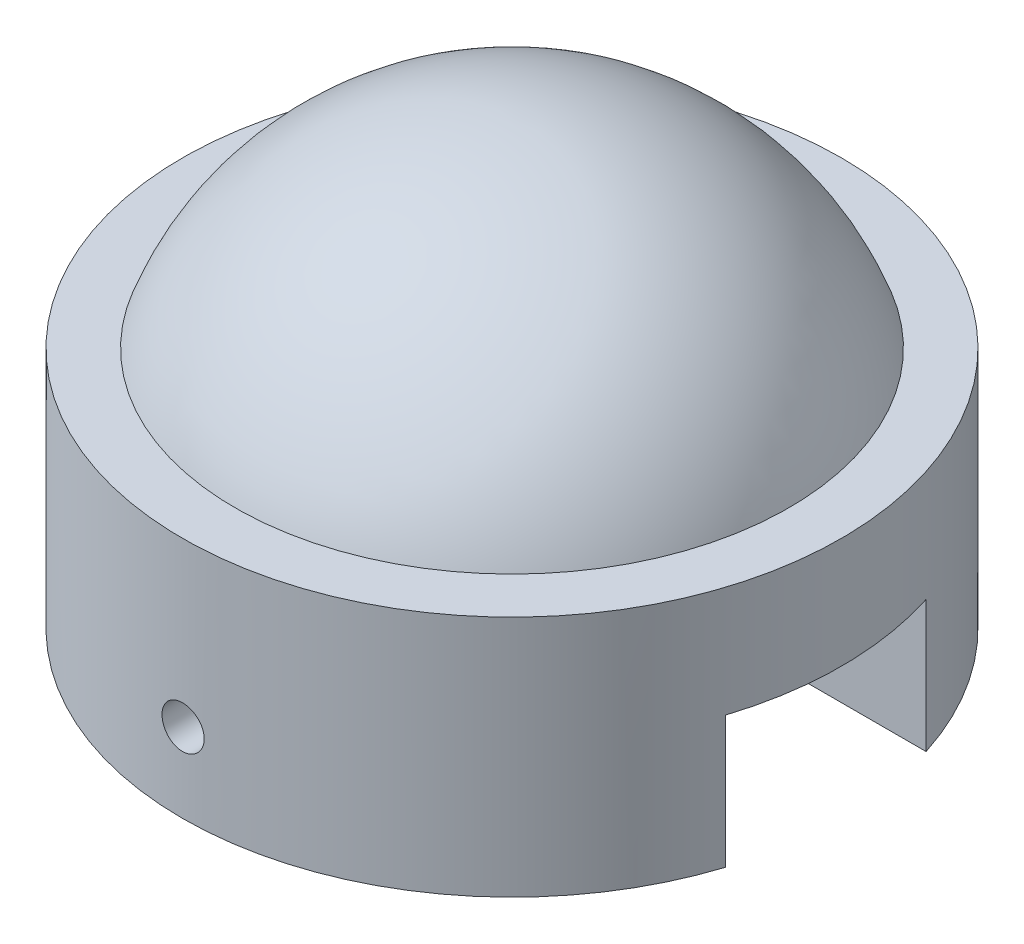
ISO-10303-21;
HEADER;
FILE_DESCRIPTION(('STEP AP214'),'2;1');
FILE_NAME('part.step','',(''),(''),'','','');
FILE_SCHEMA(('AUTOMOTIVE_DESIGN { 1 0 10303 214 1 1 1 1 }'));
ENDSEC;
DATA;
#1=APPLICATION_CONTEXT('core data for automotive mechanical design processes');
#2=APPLICATION_PROTOCOL_DEFINITION('international standard','automotive_design',2000,#1);
#3=PRODUCT_CONTEXT('',#1,'mechanical');
#4=PRODUCT('Part','Part','',(#3));
#5=PRODUCT_RELATED_PRODUCT_CATEGORY('part','',(#4));
#6=PRODUCT_DEFINITION_FORMATION('','',#4);
#7=PRODUCT_DEFINITION_CONTEXT('part definition',#1,'design');
#8=PRODUCT_DEFINITION('design','',#6,#7);
#9=PRODUCT_DEFINITION_SHAPE('','',#8);
#10=(LENGTH_UNIT() NAMED_UNIT(*) SI_UNIT(.MILLI.,.METRE.));
#11=(NAMED_UNIT(*) PLANE_ANGLE_UNIT() SI_UNIT($,.RADIAN.));
#12=(NAMED_UNIT(*) SI_UNIT($,.STERADIAN.) SOLID_ANGLE_UNIT());
#13=UNCERTAINTY_MEASURE_WITH_UNIT(LENGTH_MEASURE(1.E-05),#10,'distance_accuracy_value','');
#14=(GEOMETRIC_REPRESENTATION_CONTEXT(3) GLOBAL_UNCERTAINTY_ASSIGNED_CONTEXT((#13)) GLOBAL_UNIT_ASSIGNED_CONTEXT((#10,
#11,#12)) REPRESENTATION_CONTEXT('',''));
#15=CARTESIAN_POINT('',(0.,0.,0.));
#16=DIRECTION('',(0.,0.,1.));
#17=DIRECTION('',(1.,0.,0.));
#18=AXIS2_PLACEMENT_3D('',#15,#16,#17);
#19=CARTESIAN_POINT('',(-3.9,0.,0.));
#20=DIRECTION('',(0.,1.,0.));
#21=DIRECTION('',(0.,0.,1.));
#22=AXIS2_PLACEMENT_3D('',#19,#20,#21);
#23=PLANE('',#22);
#24=DIRECTION('',(-1.,0.,0.));
#25=VECTOR('',#24,1.);
#26=CARTESIAN_POINT('',(10.,0.,-1.9));
#27=LINE('',#26,#25);
#28=CARTESIAN_POINT('',(-3.40587727318528,0.,-1.9));
#29=VERTEX_POINT('',#28);
#30=CARTESIAN_POINT('',(-5.95420019817943,0.,-1.9));
#31=VERTEX_POINT('',#30);
#32=EDGE_CURVE('E207',#29,#31,#27,.T.);
#33=ORIENTED_EDGE('',*,*,#32,.T.);
#34=CARTESIAN_POINT('',(0.,0.,0.));
#35=DIRECTION('',(0.,-1.,0.));
#36=DIRECTION('',(0.,0.,-1.));
#37=AXIS2_PLACEMENT_3D('',#34,#35,#36);
#38=CIRCLE('',#37,6.25);
#39=CARTESIAN_POINT('',(5.95420019817943,0.,-1.9));
#40=VERTEX_POINT('',#39);
#41=EDGE_CURVE('E124',#31,#40,#38,.T.);
#42=ORIENTED_EDGE('',*,*,#41,.T.);
#43=CARTESIAN_POINT('',(3.40587727318528,0.,-1.9));
#44=VERTEX_POINT('',#43);
#45=EDGE_CURVE('E212',#40,#44,#27,.T.);
#46=ORIENTED_EDGE('',*,*,#45,.T.);
#47=CARTESIAN_POINT('',(0.,0.,0.));
#48=DIRECTION('',(0.,-1.,0.));
#49=DIRECTION('',(0.,0.,-1.));
#50=AXIS2_PLACEMENT_3D('',#47,#48,#49);
#51=CIRCLE('',#50,3.9);
#52=EDGE_CURVE('E139',#29,#44,#51,.T.);
#53=ORIENTED_EDGE('',*,*,#52,.F.);
#54=EDGE_LOOP('',(#33,#42,#46,#53));
#55=FACE_BOUND('',#54,.T.);
#56=ADVANCED_FACE('F33',(#55),#23,.F.);
#57=DIRECTION('',(-1.,0.,0.));
#58=VECTOR('',#57,1.);
#59=CARTESIAN_POINT('',(10.,0.,1.9));
#60=LINE('',#59,#58);
#61=CARTESIAN_POINT('',(5.95420019817943,0.,1.9));
#62=VERTEX_POINT('',#61);
#63=CARTESIAN_POINT('',(3.40587727318528,0.,1.9));
#64=VERTEX_POINT('',#63);
#65=EDGE_CURVE('E104',#62,#64,#60,.T.);
#66=ORIENTED_EDGE('',*,*,#65,.F.);
#67=CARTESIAN_POINT('',(-5.95420019817943,0.,1.9));
#68=VERTEX_POINT('',#67);
#69=EDGE_CURVE('E116',#62,#68,#38,.T.);
#70=ORIENTED_EDGE('',*,*,#69,.T.);
#71=CARTESIAN_POINT('',(-3.40587727318528,0.,1.9));
#72=VERTEX_POINT('',#71);
#73=EDGE_CURVE('E60',#72,#68,#60,.T.);
#74=ORIENTED_EDGE('',*,*,#73,.F.);
#75=EDGE_CURVE('E118',#64,#72,#51,.T.);
#76=ORIENTED_EDGE('',*,*,#75,.F.);
#77=EDGE_LOOP('',(#66,#70,#74,#76));
#78=FACE_BOUND('',#77,.T.);
#79=ADVANCED_FACE('F115',(#78),#23,.F.);
#80=CARTESIAN_POINT('',(0.,0.,0.));
#81=DIRECTION('',(0.,-1.,0.));
#82=DIRECTION('',(0.,0.,-1.));
#83=AXIS2_PLACEMENT_3D('',#80,#81,#82);
#84=CYLINDRICAL_SURFACE('',#83,3.9);
#85=CARTESIAN_POINT('',(0.,1.9,-3.9));
#86=CARTESIAN_POINT('',(0.0224050360369174,1.89999903130887,-3.89999973621022));
#87=CARTESIAN_POINT('',(0.0448248102239473,1.89811121514567,-3.89980487819636));
#88=CARTESIAN_POINT('',(0.089042582149286,1.89060896527527,-3.89904628875805));
#89=CARTESIAN_POINT('',(0.110839870809206,1.88499044568791,-3.89848215290876));
#90=CARTESIAN_POINT('',(0.153165968103049,1.87019225898817,-3.89704867680895));
#91=CARTESIAN_POINT('',(0.173695542151248,1.86101476555457,-3.89617952288201));
#92=CARTESIAN_POINT('',(0.212918477646498,1.83936341776893,-3.89423314908145));
#93=CARTESIAN_POINT('',(0.231612198574761,1.82689021052806,-3.89315597006458));
#94=CARTESIAN_POINT('',(0.266707784916821,1.79895098298983,-3.8909096258248));
#95=CARTESIAN_POINT('',(0.283101742843247,1.78347505270229,-3.88974016383611));
#96=CARTESIAN_POINT('',(0.31306446115213,1.74999083863106,-3.88744350750644));
#97=CARTESIAN_POINT('',(0.326633089691566,1.73198243673613,-3.88631631513997));
#98=CARTESIAN_POINT('',(0.350588139183903,1.6938947868407,-3.88422880153916));
#99=CARTESIAN_POINT('',(0.360967379022695,1.67381099977894,-3.88326885895079));
#100=CARTESIAN_POINT('',(0.378203168631359,1.63217413300122,-3.88162823644546));
#101=CARTESIAN_POINT('',(0.385059809687443,1.61062109137658,-3.88094754929185));
#102=CARTESIAN_POINT('',(0.395032264238243,1.56673832494834,-3.87994520570983));
#103=CARTESIAN_POINT('',(0.398161217916159,1.54441161556473,-3.87962228841814));
#104=CARTESIAN_POINT('',(0.400630100836543,1.49954778714652,-3.8793681375379));
#105=CARTESIAN_POINT('',(0.399970134524708,1.47701067392903,-3.87943689315247));
#106=CARTESIAN_POINT('',(0.394890737825368,1.43245645492763,-3.87995716792142));
#107=CARTESIAN_POINT('',(0.390485666401369,1.41043769267821,-3.88040722511922));
#108=CARTESIAN_POINT('',(0.378063451163112,1.36745365397513,-3.88163710963168));
#109=CARTESIAN_POINT('',(0.370046256275926,1.34648839242191,-3.88241694160911));
#110=CARTESIAN_POINT('',(0.350611561952498,1.30616119252546,-3.8842201882922));
#111=CARTESIAN_POINT('',(0.339187704062033,1.28680233964341,-3.88524405776426));
#112=CARTESIAN_POINT('',(0.313268532203266,1.25027125177685,-3.88741963367097));
#113=CARTESIAN_POINT('',(0.298773123645499,1.23309908415815,-3.88857134404202));
#114=CARTESIAN_POINT('',(0.267042180912524,1.20134539095005,-3.89087934613934));
#115=CARTESIAN_POINT('',(0.249794248187567,1.18677625189999,-3.89203563433556));
#116=CARTESIAN_POINT('',(0.213090881645087,1.16073822597723,-3.89421746691946));
#117=CARTESIAN_POINT('',(0.19363544515332,1.14926934286034,-3.89524301114875));
#118=CARTESIAN_POINT('',(0.153060667919829,1.1297578385191,-3.89704816699728));
#119=CARTESIAN_POINT('',(0.131941016253038,1.12171585934963,-3.89782773252357));
#120=CARTESIAN_POINT('',(0.0886414246791094,1.10929559278069,-3.89905262995733));
#121=CARTESIAN_POINT('',(0.066461518154561,1.10491719011211,-3.89949797238059));
#122=CARTESIAN_POINT('',(0.0217782753334561,1.09996410862448,-3.90000289305564));
#123=CARTESIAN_POINT('',(-0.000723147810683021,1.09937234003915,-3.9000642044824));
#124=CARTESIAN_POINT('',(-0.0455048507816828,1.10196441919759,-3.89979880534974));
#125=CARTESIAN_POINT('',(-0.0677851337495857,1.10514821323622,-3.89947210030964));
#126=CARTESIAN_POINT('',(-0.111442673121615,1.1151868616078,-3.89846848642197));
#127=CARTESIAN_POINT('',(-0.132821791663694,1.12203370052843,-3.89779234232038));
#128=CARTESIAN_POINT('',(-0.174128044853109,1.13919583588782,-3.89616568925689));
#129=CARTESIAN_POINT('',(-0.194055145337151,1.14951121390284,-3.89521517384213));
#130=CARTESIAN_POINT('',(-0.231968886525854,1.17335989844567,-3.89314174738375));
#131=CARTESIAN_POINT('',(-0.24994844138033,1.18690441715917,-3.89201824060576));
#132=CARTESIAN_POINT('',(-0.283384957496126,1.21681084746333,-3.88972677487453));
#133=CARTESIAN_POINT('',(-0.298841852071503,1.2331728335096,-3.88855881474718));
#134=CARTESIAN_POINT('',(-0.326853741467384,1.26832437685696,-3.88630485167593));
#135=CARTESIAN_POINT('',(-0.339397509653901,1.28712290451826,-3.88521917631926));
#136=CARTESIAN_POINT('',(-0.361149862592383,1.32656973179389,-3.88325772586681));
#137=CARTESIAN_POINT('',(-0.37035849499238,1.34721800497624,-3.88238194777236));
#138=CARTESIAN_POINT('',(-0.385160439515946,1.38973990451383,-3.8809415118253));
#139=CARTESIAN_POINT('',(-0.390760398976992,1.41161119674579,-3.88037628221332));
#140=CARTESIAN_POINT('',(-0.398207589471724,1.45598973526181,-3.87961917617117));
#141=CARTESIAN_POINT('',(-0.400054934234572,1.47849696225187,-3.87942728842626));
#142=CARTESIAN_POINT('',(-0.399942830814951,1.52339687943605,-3.87943883854268));
#143=CARTESIAN_POINT('',(-0.398001018114547,1.54578961621698,-3.87964044500576));
#144=CARTESIAN_POINT('',(-0.390402731347687,1.58992894490839,-3.88041235949326));
#145=CARTESIAN_POINT('',(-0.384746253395842,1.61167553614298,-3.88098266790332));
#146=CARTESIAN_POINT('',(-0.369884130782164,1.65390492865067,-3.88242721328932));
#147=CARTESIAN_POINT('',(-0.36067903523041,1.67438792488281,-3.88330140324082));
#148=CARTESIAN_POINT('',(-0.338982782846501,1.71352100814817,-3.88525530576914));
#149=CARTESIAN_POINT('',(-0.326491638832624,1.73217110233082,-3.88633501754426));
#150=CARTESIAN_POINT('',(-0.298511694167548,1.76719934519414,-3.88858432819315));
#151=CARTESIAN_POINT('',(-0.283009747892725,1.78356696928079,-3.88975430716862));
#152=CARTESIAN_POINT('',(-0.249474458835927,1.81347621976018,-3.89204886236119));
#153=CARTESIAN_POINT('',(-0.231440511557419,1.82701716937984,-3.8931734276533));
#154=CARTESIAN_POINT('',(-0.193300893843417,1.85091700369955,-3.89525354700934));
#155=CARTESIAN_POINT('',(-0.173189894132027,1.86126741704842,-3.89620864831887));
#156=CARTESIAN_POINT('',(-0.131518235690599,1.87843046552348,-3.89783734588499));
#157=CARTESIAN_POINT('',(-0.10995923696413,1.8852470762115,-3.89851125831439));
#158=CARTESIAN_POINT('',(-0.0735659323831241,1.89345553029148,-3.89933294475621));
#159=CARTESIAN_POINT('',(-0.0589640028883835,1.89590633737246,-3.89958191923254));
#160=CARTESIAN_POINT('',(-0.029576856287532,1.89917888840929,-3.89991553356945));
#161=CARTESIAN_POINT('',(-0.0147916399870197,1.90000063952276,-3.90000017415207));
#162=CARTESIAN_POINT('',(0.,1.9,-3.9));
#163=B_SPLINE_CURVE_WITH_KNOTS('',3,(#85,#86,#87,#88,#89,#90,#91,#92,#93,#94,#95,#96,#97,#98,
#99,#100,#101,#102,#103,#104,#105,#106,#107,#108,#109,#110,#111,#112,#113,#114,#115,#116,#117,
#118,#119,#120,#121,#122,#123,#124,#125,#126,#127,#128,#129,#130,#131,#132,#133,#134,#135,#136,
#137,#138,#139,#140,#141,#142,#143,#144,#145,#146,#147,#148,#149,#150,#151,#152,#153,#154,#155,
#156,#157,#158,#159,#160,#161,#162),.UNSPECIFIED.,.T.,.F.,(4,2,2,2,2,2,2,2,2,2,2,2,2,2,2,2,2,2,
2,2,2,2,2,2,2,2,2,2,2,2,2,2,2,2,2,2,2,2,4),(0.,0.0671610931620392,0.134395862990819,
0.201589633023958,0.268770219397855,0.336176416052526,0.403585757489488,0.471145781707632,
0.538704055056545,0.606023472585476,0.67334103439042,0.740401654472328,0.807463222774796,
0.874650751765174,0.941840350119507,1.00934161659733,1.07684296484937,1.14435695440569,
1.21186881965267,1.27907577542404,1.34628177522772,1.41334131391417,1.48040242987821,
1.54769987577989,1.614999100386,1.68255353192952,1.75010699830615,1.81753566975117,
1.88496229762886,1.95207585715313,2.0191894868756,2.0862927356577,2.15339572268611,
2.2207985596855,2.28821751606417,2.35581396788451,2.42333420711121,2.46767366161611,
2.51201292130535),.UNSPECIFIED.);
#164=CARTESIAN_POINT('',(0.,1.9,-3.9));
#165=VERTEX_POINT('',#164);
#166=EDGE_CURVE('E172',#165,#165,#163,.T.);
#167=ORIENTED_EDGE('',*,*,#166,.T.);
#168=EDGE_LOOP('',(#167));
#169=FACE_BOUND('',#168,.T.);
#170=CARTESIAN_POINT('',(0.4,1.5,3.87943294825416));
#171=CARTESIAN_POINT('',(0.399999030996807,1.5224046865797,3.87943321725911));
#172=CARTESIAN_POINT('',(0.398111271733158,1.54482411240049,3.8796291292902));
#173=CARTESIAN_POINT('',(0.390609268414111,1.5890411605254,3.88039148365016));
#174=CARTESIAN_POINT('',(0.384990937267086,1.61083807347723,3.88095833235515));
#175=CARTESIAN_POINT('',(0.370193301804084,1.6531633762959,3.88239769229377));
#176=CARTESIAN_POINT('',(0.361016180123982,1.67369253475821,3.8832700161452));
#177=CARTESIAN_POINT('',(0.339365707818552,1.71291477378848,3.88522180732534));
#178=CARTESIAN_POINT('',(0.326893003393002,1.73160821332071,3.88630123403385));
#179=CARTESIAN_POINT('',(0.298954283990447,1.766704116899,3.8885502225038));
#180=CARTESIAN_POINT('',(0.283478246667961,1.78309858444927,3.88972007794092));
#181=CARTESIAN_POINT('',(0.249993604479354,1.8130622864872,3.89201544727453));
#182=CARTESIAN_POINT('',(0.231984882893414,1.82663139069526,3.89314095912436));
#183=CARTESIAN_POINT('',(0.193896952383097,1.85058693800163,3.89522373840269));
#184=CARTESIAN_POINT('',(0.173813259376506,1.86096628723477,3.89618062883916));
#185=CARTESIAN_POINT('',(0.132176597010932,1.8782023050293,3.89781515047165));
#186=CARTESIAN_POINT('',(0.110623665203589,1.88505906358487,3.89849278880185));
#187=CARTESIAN_POINT('',(0.066741237048571,1.89503176306127,3.89949039271603));
#188=CARTESIAN_POINT('',(0.0444147583461273,1.89816085464525,3.89981161540528));
#189=CARTESIAN_POINT('',(-0.000448618250968849,1.90063009330453,3.90006447197801));
#190=CARTESIAN_POINT('',(-0.0229855104117429,1.89997034332864,3.89999611644694));
#191=CARTESIAN_POINT('',(-0.0675406825498407,1.89489128948764,3.89947854624816));
#192=CARTESIAN_POINT('',(-0.0895605935138925,1.89048612680219,3.89903076416483));
#193=CARTESIAN_POINT('',(-0.132546882514425,1.87806333100316,3.8978063041059));
#194=CARTESIAN_POINT('',(-0.153513246254447,1.870045648883,3.89702962166853));
#195=CARTESIAN_POINT('',(-0.193841783586396,1.85060994499782,3.89523221212191));
#196=CARTESIAN_POINT('',(-0.213200926797134,1.83918567834116,3.8942110374973));
#197=CARTESIAN_POINT('',(-0.249732422031208,1.81326563366964,3.89203919703728));
#198=CARTESIAN_POINT('',(-0.266904706539635,1.79876976086186,3.89088852720603));
#199=CARTESIAN_POINT('',(-0.298657876648993,1.76703848841306,3.8885805404873));
#200=CARTESIAN_POINT('',(-0.313226469409928,1.74979078511301,3.88742321738451));
#201=CARTESIAN_POINT('',(-0.339263502375182,1.71308807238632,3.88523764213965));
#202=CARTESIAN_POINT('',(-0.350731937690617,1.69363305947888,3.88420939020112));
#203=CARTESIAN_POINT('',(-0.370243119735034,1.65305839785227,3.88239829699401));
#204=CARTESIAN_POINT('',(-0.378285086269966,1.63193837131167,3.88161551162794));
#205=CARTESIAN_POINT('',(-0.390705212733786,1.58863796477296,3.8803851274376));
#206=CARTESIAN_POINT('',(-0.39508349021159,1.56645761881918,3.87993751785931));
#207=CARTESIAN_POINT('',(-0.400036099408696,1.5217741702285,3.87943003608846));
#208=CARTESIAN_POINT('',(-0.400627638224474,1.49927299389958,3.87936840999867));
#209=CARTESIAN_POINT('',(-0.398035187622991,1.45449183972601,3.87963524327794));
#210=CARTESIAN_POINT('',(-0.39485125192046,1.43221185873889,3.87996369709723));
#211=CARTESIAN_POINT('',(-0.384812637446832,1.38855582840869,3.88097208546549));
#212=CARTESIAN_POINT('',(-0.377966112950599,1.36717788442873,3.88165123911096));
#213=CARTESIAN_POINT('',(-0.360804999721467,1.32587384129241,3.88328386967787));
#214=CARTESIAN_POINT('',(-0.350490327556261,1.30594777707757,3.88423735319871));
#215=CARTESIAN_POINT('',(-0.326642683309124,1.26803474439411,3.88631545104621));
#216=CARTESIAN_POINT('',(-0.313098319750441,1.25005497469871,3.88744066591379));
#217=CARTESIAN_POINT('',(-0.283192074102151,1.2166179528585,3.88973348454209));
#218=CARTESIAN_POINT('',(-0.266830118606802,1.2011607664541,3.89090108940654));
#219=CARTESIAN_POINT('',(-0.231678448368392,1.17314824295712,3.8931524310015));
#220=CARTESIAN_POINT('',(-0.212879757738741,1.16060413861936,3.89423583270959));
#221=CARTESIAN_POINT('',(-0.173432514558528,1.13885119594298,3.89619180821333));
#222=CARTESIAN_POINT('',(-0.152783988500523,1.1296423098483,3.89706438502767));
#223=CARTESIAN_POINT('',(-0.110262245761607,1.11484019831059,3.89849888401578));
#224=CARTESIAN_POINT('',(-0.0883914017061293,1.10924021559892,3.89906138648171));
#225=CARTESIAN_POINT('',(-0.0440138086870632,1.10179282675156,3.8998147415447));
#226=CARTESIAN_POINT('',(-0.0215070786094926,1.099945309285,3.90000560516781));
#227=CARTESIAN_POINT('',(0.0233931322592455,1.10005690742464,3.89999416745876));
#228=CARTESIAN_POINT('',(0.0457866588586806,1.10199859633436,3.89979366602765));
#229=CARTESIAN_POINT('',(0.0899275981830778,1.1095969132956,3.89902558052867));
#230=CARTESIAN_POINT('',(0.111675010474538,1.11525354383955,3.89845799621453));
#231=CARTESIAN_POINT('',(0.153906054051694,1.13011628304939,3.8970193270836));
#232=CARTESIAN_POINT('',(0.174389877352365,1.13932185086982,3.89614828851412));
#233=CARTESIAN_POINT('',(0.213524417784899,1.1610193039577,3.89419974606402));
#234=CARTESIAN_POINT('',(0.232175142579189,1.17351117548746,3.89312224304649));
#235=CARTESIAN_POINT('',(0.267203353106964,1.20149192218366,3.8908755170325));
#236=CARTESIAN_POINT('',(0.283570446689805,1.216993776457,3.88970591035641));
#237=CARTESIAN_POINT('',(0.313478669786864,1.25052866297329,3.88741003020044));
#238=CARTESIAN_POINT('',(0.327019121135368,1.26856230090797,3.88628376717227));
#239=CARTESIAN_POINT('',(0.350918417043304,1.30670166470862,3.88419888822739));
#240=CARTESIAN_POINT('',(0.361268701314714,1.32681277558432,3.88324072629607));
#241=CARTESIAN_POINT('',(0.378431477709382,1.36848466942964,3.88160593334562));
#242=CARTESIAN_POINT('',(0.385247947123085,1.39004379165222,3.88092898599225));
#243=CARTESIAN_POINT('',(0.393456004614913,1.42643671854524,3.88010340350025));
#244=CARTESIAN_POINT('',(0.395906633184329,1.4410381188358,3.87985317752112));
#245=CARTESIAN_POINT('',(0.399178947088685,1.47042420533096,3.87951786147196));
#246=CARTESIAN_POINT('',(0.400000639715806,1.48520889071477,3.87943277066268));
#247=CARTESIAN_POINT('',(0.4,1.5,3.87943294825416));
#248=B_SPLINE_CURVE_WITH_KNOTS('',3,(#170,#171,#172,#173,#174,#175,#176,#177,#178,#179,#180,
#181,#182,#183,#184,#185,#186,#187,#188,#189,#190,#191,#192,#193,#194,#195,#196,#197,#198,#199,
#200,#201,#202,#203,#204,#205,#206,#207,#208,#209,#210,#211,#212,#213,#214,#215,#216,#217,#218,
#219,#220,#221,#222,#223,#224,#225,#226,#227,#228,#229,#230,#231,#232,#233,#234,#235,#236,#237,
#238,#239,#240,#241,#242,#243,#244,#245,#246,#247),.UNSPECIFIED.,.T.,.F.,(4,2,2,2,2,2,2,2,2,2,2,
2,2,2,2,2,2,2,2,2,2,2,2,2,2,2,2,2,2,2,2,2,2,2,2,2,2,2,4),(0.,0.067160043459882,
0.134393786919231,0.201586360413217,0.268765768513101,0.336173338860716,0.403584016733184,
0.471143545625014,0.538701348438966,0.606020104677001,0.673337031766604,0.740400919994249,
0.80746571802198,0.874654221900009,0.941844799586727,1.00934467483684,1.07684465653226,
1.14435999951668,1.21187317619834,1.27907935115014,1.34628456995242,1.41334078405776,
1.48039861143203,1.5476965518924,1.61499624590794,1.68255128925235,1.75010536525675,
1.81753258344805,1.88495780113031,1.95207365850354,2.01918956090624,2.08629523912435,
2.15340063682601,2.22080209169681,2.28821969893216,2.3558166661597,2.42333738726957,
2.46767525318395,2.51201292061271),.UNSPECIFIED.);
#249=CARTESIAN_POINT('',(0.4,1.5,3.87943294825416));
#250=VERTEX_POINT('',#249);
#251=EDGE_CURVE('E167',#250,#250,#248,.T.);
#252=ORIENTED_EDGE('',*,*,#251,.T.);
#253=EDGE_LOOP('',(#252));
#254=FACE_BOUND('',#253,.T.);
#255=CARTESIAN_POINT('',(0.,4.2,0.));
#256=DIRECTION('',(0.,-1.,0.));
#257=DIRECTION('',(0.,0.,-1.));
#258=AXIS2_PLACEMENT_3D('',#255,#256,#257);
#259=CIRCLE('',#258,3.9);
#260=CARTESIAN_POINT('',(0.,4.2,-3.9));
#261=VERTEX_POINT('',#260);
#262=EDGE_CURVE('E136',#261,#261,#259,.T.);
#263=ORIENTED_EDGE('',*,*,#262,.F.);
#264=EDGE_LOOP('',(#263));
#265=FACE_BOUND('',#264,.T.);
#266=DIRECTION('',(0.,-1.,0.));
#267=VECTOR('',#266,1.);
#268=CARTESIAN_POINT('',(3.40587727318528,0.,-1.9));
#269=LINE('',#268,#267);
#270=CARTESIAN_POINT('',(3.40587727318528,2.5,-1.9));
#271=VERTEX_POINT('',#270);
#272=EDGE_CURVE('E234',#271,#44,#269,.T.);
#273=ORIENTED_EDGE('',*,*,#272,.F.);
#274=CARTESIAN_POINT('',(0.,2.5,0.));
#275=DIRECTION('',(0.,-1.,0.));
#276=DIRECTION('',(0.,0.,-1.));
#277=AXIS2_PLACEMENT_3D('',#274,#275,#276);
#278=CIRCLE('',#277,3.9);
#279=CARTESIAN_POINT('',(3.40587727318528,2.5,1.9));
#280=VERTEX_POINT('',#279);
#281=EDGE_CURVE('E223',#280,#271,#278,.F.);
#282=ORIENTED_EDGE('',*,*,#281,.F.);
#283=DIRECTION('',(0.,-1.,0.));
#284=VECTOR('',#283,1.);
#285=CARTESIAN_POINT('',(3.40587727318528,0.,1.9));
#286=LINE('',#285,#284);
#287=EDGE_CURVE('E227',#64,#280,#286,.F.);
#288=ORIENTED_EDGE('',*,*,#287,.F.);
#289=ORIENTED_EDGE('',*,*,#75,.T.);
#290=DIRECTION('',(0.,-1.,0.));
#291=VECTOR('',#290,1.);
#292=CARTESIAN_POINT('',(-3.40587727318528,0.,1.9));
#293=LINE('',#292,#291);
#294=CARTESIAN_POINT('',(-3.40587727318528,2.5,1.9));
#295=VERTEX_POINT('',#294);
#296=EDGE_CURVE('E224',#295,#72,#293,.T.);
#297=ORIENTED_EDGE('',*,*,#296,.F.);
#298=CARTESIAN_POINT('',(-3.40587727318528,2.5,-1.9));
#299=VERTEX_POINT('',#298);
#300=EDGE_CURVE('E233',#299,#295,#278,.F.);
#301=ORIENTED_EDGE('',*,*,#300,.F.);
#302=DIRECTION('',(0.,-1.,0.));
#303=VECTOR('',#302,1.);
#304=CARTESIAN_POINT('',(-3.40587727318528,0.,-1.9));
#305=LINE('',#304,#303);
#306=EDGE_CURVE('E130',#29,#299,#305,.F.);
#307=ORIENTED_EDGE('',*,*,#306,.F.);
#308=ORIENTED_EDGE('',*,*,#52,.T.);
#309=EDGE_LOOP('',(#273,#282,#288,#289,#297,#301,#307,#308));
#310=FACE_BOUND('',#309,.T.);
#311=ADVANCED_FACE('F177',(#169,#254,#265,#310),#84,.F.);
#312=CARTESIAN_POINT('',(0.,0.,0.));
#313=DIRECTION('',(0.,-1.,0.));
#314=DIRECTION('',(0.,0.,-1.));
#315=AXIS2_PLACEMENT_3D('',#312,#313,#314);
#316=CYLINDRICAL_SURFACE('',#315,6.25);
#317=CARTESIAN_POINT('',(0.,1.9,-6.25));
#318=CARTESIAN_POINT('',(-0.0224435293456439,1.89999901290593,-6.24999982999009));
#319=CARTESIAN_POINT('',(-0.0449027462962842,1.89810473223254,-6.24987781651468));
#320=CARTESIAN_POINT('',(-0.0892009521053,1.8905753042846,-6.24940281084195));
#321=CARTESIAN_POINT('',(-0.111039189488894,1.8849358102119,-6.24904955025967));
#322=CARTESIAN_POINT('',(-0.153447367682333,1.87007866742751,-6.24815201093505));
#323=CARTESIAN_POINT('',(-0.174017973888437,1.86086291480323,-6.24760783342912));
#324=CARTESIAN_POINT('',(-0.213314942150303,1.83911795074811,-6.24638965384087));
#325=CARTESIAN_POINT('',(-0.232041723488104,1.82658949501852,-6.2457156813772));
#326=CARTESIAN_POINT('',(-0.267154086248556,1.79855332420001,-6.24431248294859));
#327=CARTESIAN_POINT('',(-0.283536403111893,1.78304152400417,-6.24358318206106));
#328=CARTESIAN_POINT('',(-0.313466877774332,1.74948742601905,-6.24215216205289));
#329=CARTESIAN_POINT('',(-0.327014916777447,1.73144502221493,-6.24145044408937));
#330=CARTESIAN_POINT('',(-0.350902406161839,1.69332327180022,-6.24015314296202));
#331=CARTESIAN_POINT('',(-0.361239130244036,1.67324221352271,-6.23955765016143));
#332=CARTESIAN_POINT('',(-0.378393126056472,1.63162517640297,-6.23854092798865));
#333=CARTESIAN_POINT('',(-0.385210437145424,1.61008921383445,-6.23811969666766));
#334=CARTESIAN_POINT('',(-0.39512299005704,1.56620526526469,-6.23749971648003));
#335=CARTESIAN_POINT('',(-0.398223365351893,1.54385844322216,-6.2373006607922));
#336=CARTESIAN_POINT('',(-0.400629886125329,1.49896074178302,-6.23714656076724));
#337=CARTESIAN_POINT('',(-0.399936076335905,1.47640986479526,-6.23719151355334));
#338=CARTESIAN_POINT('',(-0.394778180447233,1.43177918197551,-6.23752007632056));
#339=CARTESIAN_POINT('',(-0.390319650999692,1.40969873102095,-6.23780333456531));
#340=CARTESIAN_POINT('',(-0.377767496734641,1.36660027773082,-6.23857603343271));
#341=CARTESIAN_POINT('',(-0.369673849273662,1.34558228201428,-6.2390654753397));
#342=CARTESIAN_POINT('',(-0.350074905311028,1.30518752090016,-6.24019579004026));
#343=CARTESIAN_POINT('',(-0.338567089887375,1.2858119808996,-6.24083677456854));
#344=CARTESIAN_POINT('',(-0.312468299518514,1.24926552906424,-6.2421978293331));
#345=CARTESIAN_POINT('',(-0.297877288172704,1.23209464326171,-6.24291790050304));
#346=CARTESIAN_POINT('',(-0.265995003370657,1.20041258988416,-6.24435754442314));
#347=CARTESIAN_POINT('',(-0.248698921272166,1.18590626075408,-6.24507711394843));
#348=CARTESIAN_POINT('',(-0.211914319876018,1.16000242904606,-6.24643342090367));
#349=CARTESIAN_POINT('',(-0.192425799777114,1.14860492760426,-6.24707015830335));
#350=CARTESIAN_POINT('',(-0.151806582540981,1.12924268753214,-6.24818910538994));
#351=CARTESIAN_POINT('',(-0.130675796882755,1.12127813409542,-6.24867130673991));
#352=CARTESIAN_POINT('',(-0.0873731934026922,1.10901111644356,-6.24942673407828));
#353=CARTESIAN_POINT('',(-0.0652013883315491,1.10470860738703,-6.24969996262554));
#354=CARTESIAN_POINT('',(-0.020488099886413,1.09989381078506,-6.25000632646719));
#355=CARTESIAN_POINT('',(0.00205266041056363,1.09937483405523,-6.25003988548878));
#356=CARTESIAN_POINT('',(0.0469009118336964,1.10212435331865,-6.24986425605434));
#357=CARTESIAN_POINT('',(0.0692084042329397,1.10539282863054,-6.24965506892382));
#358=CARTESIAN_POINT('',(0.112938033333791,1.11561893293836,-6.24901776762715));
#359=CARTESIAN_POINT('',(0.134360891055967,1.12257349096489,-6.2485898357134));
#360=CARTESIAN_POINT('',(0.175735393457801,1.13997122609859,-6.24756318409439));
#361=CARTESIAN_POINT('',(0.195687024266058,1.15041443609323,-6.24696446277912));
#362=CARTESIAN_POINT('',(0.233583339182231,1.17451004513163,-6.24566244101044));
#363=CARTESIAN_POINT('',(0.251525179072476,1.18816690946008,-6.24495899554984));
#364=CARTESIAN_POINT('',(0.284863972035593,1.21829566242458,-6.24352716887002));
#365=CARTESIAN_POINT('',(0.30026089886377,1.23476758008762,-6.24279878739374));
#366=CARTESIAN_POINT('',(0.328095480442748,1.27008773234529,-6.24139795339497));
#367=CARTESIAN_POINT('',(0.340528793937329,1.28893939187253,-6.24072558384754));
#368=CARTESIAN_POINT('',(0.362053512514474,1.32846669460952,-6.23951392119569));
#369=CARTESIAN_POINT('',(0.371144939015963,1.34914232612796,-6.23897462723837));
#370=CARTESIAN_POINT('',(0.38572030163153,1.39171484106055,-6.23809053276432));
#371=CARTESIAN_POINT('',(0.391206965447473,1.41361078742734,-6.23774558521509));
#372=CARTESIAN_POINT('',(0.398425963289392,1.45801539181972,-6.2372886768098));
#373=CARTESIAN_POINT('',(0.400158336737153,1.48052404340911,-6.23717671350731));
#374=CARTESIAN_POINT('',(0.399819193949046,1.52547195516532,-6.23719845924074));
#375=CARTESIAN_POINT('',(0.397754502521043,1.54791126735905,-6.23733172750008));
#376=CARTESIAN_POINT('',(0.389893993771808,1.59212389353857,-6.2378279847837));
#377=CARTESIAN_POINT('',(0.384098169744738,1.6138972063273,-6.23819097422085));
#378=CARTESIAN_POINT('',(0.368941467377582,1.65616075952915,-6.23910566026413));
#379=CARTESIAN_POINT('',(0.359580623232552,1.67665101224697,-6.23965735506022));
#380=CARTESIAN_POINT('',(0.337560524278987,1.71576996125791,-6.24088727333243));
#381=CARTESIAN_POINT('',(0.324901352789193,1.73439870455801,-6.24156549361228));
#382=CARTESIAN_POINT('',(0.296618670711529,1.76930047340965,-6.24297345899062));
#383=CARTESIAN_POINT('',(0.280990214584566,1.78556948780205,-6.24370328875646));
#384=CARTESIAN_POINT('',(0.247219461129954,1.81525872264884,-6.24513150629917));
#385=CARTESIAN_POINT('',(0.229076550125794,1.82867824562721,-6.24582988634514));
#386=CARTESIAN_POINT('',(0.19077036387533,1.85229794350911,-6.2471172666996));
#387=CARTESIAN_POINT('',(0.17060454145173,1.8624939907644,-6.24770612637385));
#388=CARTESIAN_POINT('',(0.128858058851228,1.87934302165374,-6.24870624499699));
#389=CARTESIAN_POINT('',(0.107279087173315,1.88600015003433,-6.24911771159961));
#390=CARTESIAN_POINT('',(0.0713069873602299,1.89385430254805,-6.24960899199658));
#391=CARTESIAN_POINT('',(0.0571463112331617,1.89615595385045,-6.24975496736442));
#392=CARTESIAN_POINT('',(0.0286592225410796,1.89922911664919,-6.24995052558149));
#393=CARTESIAN_POINT('',(0.0143328102175429,1.90000063037465,-6.25000010857115));
#394=CARTESIAN_POINT('',(0.,1.9,-6.25));
#395=B_SPLINE_CURVE_WITH_KNOTS('',3,(#317,#318,#319,#320,#321,#322,#323,#324,#325,#326,#327,
#328,#329,#330,#331,#332,#333,#334,#335,#336,#337,#338,#339,#340,#341,#342,#343,#344,#345,#346,
#347,#348,#349,#350,#351,#352,#353,#354,#355,#356,#357,#358,#359,#360,#361,#362,#363,#364,#365,
#366,#367,#368,#369,#370,#371,#372,#373,#374,#375,#376,#377,#378,#379,#380,#381,#382,#383,#384,
#385,#386,#387,#388,#389,#390,#391,#392,#393,#394),.UNSPECIFIED.,.T.,.F.,(4,2,2,2,2,2,2,2,2,2,2,
2,2,2,2,2,2,2,2,2,2,2,2,2,2,2,2,2,2,2,2,2,2,2,2,2,2,2,4),(0.,0.0672782643303216,
0.134634750458097,0.201955573705848,0.269261052806198,0.336659358341955,0.404060488246098,
0.47151868406918,0.538976125469503,0.606340293451868,0.673703667238114,0.740967787465207,
0.808232326692201,0.875546616625498,0.942861701324242,1.01029783738024,1.07773399808149,
1.14517379623459,1.21261276858182,1.27993248164239,1.34725182710571,1.41451517506304,
1.48177915712892,1.54913715834914,1.61649585416277,1.68395262234449,1.75140895817266,
1.81881419123488,1.88621871650752,1.95350220792441,2.02078582026798,2.08806878725502,
2.155350054778,2.22274438197166,2.29015518644937,2.3576519638267,2.42506951450997,
2.46803459296752,2.51099960883296),.UNSPECIFIED.);
#396=CARTESIAN_POINT('',(0.,1.9,-6.25));
#397=VERTEX_POINT('',#396);
#398=EDGE_CURVE('E11',#397,#397,#395,.T.);
#399=ORIENTED_EDGE('',*,*,#398,.T.);
#400=EDGE_LOOP('',(#399));
#401=FACE_BOUND('',#400,.T.);
#402=CARTESIAN_POINT('',(0.4,1.5,6.23718686588754));
#403=CARTESIAN_POINT('',(0.399999012857835,1.47755652373537,6.23718703720003));
#404=CARTESIAN_POINT('',(0.398104740841618,1.45509735968779,6.23730930734362));
#405=CARTESIAN_POINT('',(0.390575350408771,1.41079926380286,6.23778523006284));
#406=CARTESIAN_POINT('',(0.384935885013448,1.38896108348172,6.23813915150506));
#407=CARTESIAN_POINT('',(0.370078826129414,1.34655302591617,6.23903812487783));
#408=CARTESIAN_POINT('',(0.360863130095296,1.32598248279218,6.23958307543851));
#409=CARTESIAN_POINT('',(0.339118299281562,1.28668562010587,6.24080257560827));
#410=CARTESIAN_POINT('',(0.32658992006307,1.26795888134117,6.24147709565539));
#411=CARTESIAN_POINT('',(0.298553826323722,1.23284647000952,6.24288092929361));
#412=CARTESIAN_POINT('',(0.28304200962298,1.21646407560544,6.24361031747688));
#413=CARTESIAN_POINT('',(0.249487846138304,1.186533451431,6.24504100895321));
#414=CARTESIAN_POINT('',(0.231445393550292,1.17298534021904,6.24574231107043));
#415=CARTESIAN_POINT('',(0.193323600887723,1.14909777571451,6.24703845626424));
#416=CARTESIAN_POINT('',(0.173242557530949,1.13876103535074,6.2476332091507));
#417=CARTESIAN_POINT('',(0.131625552854012,1.12160700531369,6.24864845522371));
#418=CARTESIAN_POINT('',(0.110089607726327,1.11478967647804,6.24906895034932));
#419=CARTESIAN_POINT('',(0.0662057105415652,1.10487708590641,6.24968778631808));
#420=CARTESIAN_POINT('',(0.0438589227400083,1.10177668934306,6.24988643361113));
#421=CARTESIAN_POINT('',(-0.00103871180498839,1.09937011417105,6.25004022335529));
#422=CARTESIAN_POINT('',(-0.0235895561517169,1.10006389105618,6.24999536866271));
#423=CARTESIAN_POINT('',(-0.0682203852191056,1.10522173527233,6.24966746420077));
#424=CARTESIAN_POINT('',(-0.0903010111972039,1.10968027906213,6.24938476339353));
#425=CARTESIAN_POINT('',(-0.133399807143999,1.12223252284537,6.24861339406903));
#426=CARTESIAN_POINT('',(-0.15441797058746,1.13032624516165,6.24812472428695));
#427=CARTESIAN_POINT('',(-0.194812933376627,1.14992534324221,6.24699583442066));
#428=CARTESIAN_POINT('',(-0.214188515890169,1.1614332203188,6.24635550329441));
#429=CARTESIAN_POINT('',(-0.25073502652087,1.18753214180678,6.24499534839362));
#430=CARTESIAN_POINT('',(-0.267905928579152,1.20212322265564,6.24427552367967));
#431=CARTESIAN_POINT('',(-0.299587901871886,1.23400555623709,6.24283586187975));
#432=CARTESIAN_POINT('',(-0.314094148739511,1.25130160355566,6.24211602708581));
#433=CARTESIAN_POINT('',(-0.339997831120737,1.28808610624519,6.24075878933277));
#434=CARTESIAN_POINT('',(-0.351395265331976,1.30757456253459,6.24012138640822));
#435=CARTESIAN_POINT('',(-0.370757457231564,1.34819376359607,6.23900099640991));
#436=CARTESIAN_POINT('',(-0.378722008771933,1.36932460690518,6.23851801860999));
#437=CARTESIAN_POINT('',(-0.390989004915842,1.41262733552931,6.23776127275573));
#438=CARTESIAN_POINT('',(-0.395291494703862,1.43479920799599,6.23748750212008));
#439=CARTESIAN_POINT('',(-0.400106218801757,1.47951252601943,6.23718052861032));
#440=CARTESIAN_POINT('',(-0.400625160568749,1.50205324652318,6.23714690001564));
#441=CARTESIAN_POINT('',(-0.397875585587731,1.54690140992125,6.23732289068983));
#442=CARTESIAN_POINT('',(-0.394607089518646,1.56920885408856,6.23753250863061));
#443=CARTESIAN_POINT('',(-0.384380992540868,1.61293825224574,6.23817098129346));
#444=CARTESIAN_POINT('',(-0.377426483333222,1.63436093213729,6.23859965227058));
#445=CARTESIAN_POINT('',(-0.360028905505843,1.6757351005243,6.23962776792466));
#446=CARTESIAN_POINT('',(-0.349585803712763,1.69568657502775,6.24022721422552));
#447=CARTESIAN_POINT('',(-0.325490352377627,1.73358278618362,6.24153036162149));
#448=CARTESIAN_POINT('',(-0.311833510028259,1.75152466111141,6.24223420815413));
#449=CARTESIAN_POINT('',(-0.281704781104489,1.7848635350296,6.24366633194871));
#450=CARTESIAN_POINT('',(-0.265232865668997,1.80026050792562,6.24439460946106));
#451=CARTESIAN_POINT('',(-0.229912692741578,1.82809518515546,6.24579477560866));
#452=CARTESIAN_POINT('',(-0.211061010031917,1.84052854791741,6.2464665805932));
#453=CARTESIAN_POINT('',(-0.171533648162543,1.8620533530174,6.24767690056224));
#454=CARTESIAN_POINT('',(-0.150857980697003,1.87114481677953,6.24821541640122));
#455=CARTESIAN_POINT('',(-0.108285491621897,1.88572020490917,6.24909808137062));
#456=CARTESIAN_POINT('',(-0.0863896125927451,1.89120687310274,6.2494423783044));
#457=CARTESIAN_POINT('',(-0.0419851499013419,1.89842590253087,6.24989840112795));
#458=CARTESIAN_POINT('',(-0.0194765726169251,1.90015830283007,6.25001012943768));
#459=CARTESIAN_POINT('',(0.0254713883549131,1.89981923671146,6.24998843311013));
#460=CARTESIAN_POINT('',(0.0479108238108175,1.89775456304116,6.24985544625398));
#461=CARTESIAN_POINT('',(0.0921237008501518,1.88989404636724,6.24936014241098));
#462=CARTESIAN_POINT('',(0.113897141275884,1.88409819687813,6.2489978250255));
#463=CARTESIAN_POINT('',(0.156160944411041,1.86894139727012,6.24808457969392));
#464=CARTESIAN_POINT('',(0.176651319314159,1.85958048103805,6.24753365354058));
#465=CARTESIAN_POINT('',(0.215770482495593,1.83756020021976,6.24630503317606));
#466=CARTESIAN_POINT('',(0.23439931785609,1.82490091908524,6.24562734217226));
#467=CARTESIAN_POINT('',(0.269301076917442,1.79661811826455,6.24421997135006));
#468=CARTESIAN_POINT('',(0.285570009638846,1.78098967798311,6.24349020650468));
#469=CARTESIAN_POINT('',(0.315259087127815,1.74721898956283,6.24206161937976));
#470=CARTESIAN_POINT('',(0.328678534208193,1.72907612756909,6.24136280471134));
#471=CARTESIAN_POINT('',(0.352298152518542,1.69076997936669,6.24007424210197));
#472=CARTESIAN_POINT('',(0.36249418190361,1.67060413723453,6.23948463488362));
#473=CARTESIAN_POINT('',(0.379343173884036,1.62885761246313,6.23848304179079));
#474=CARTESIAN_POINT('',(0.386000281496834,1.60727861843713,6.23807084822604));
#475=CARTESIAN_POINT('',(0.393854374116298,1.57130657441186,6.23757865380572));
#476=CARTESIAN_POINT('',(0.39615599849542,1.55714598065557,6.23743239103948));
#477=CARTESIAN_POINT('',(0.399229125516512,1.5286590570784,6.23723644244992));
#478=CARTESIAN_POINT('',(0.400000630403218,1.5143327275007,6.23718675648491));
#479=CARTESIAN_POINT('',(0.4,1.5,6.23718686588754));
#480=B_SPLINE_CURVE_WITH_KNOTS('',3,(#402,#403,#404,#405,#406,#407,#408,#409,#410,#411,#412,
#413,#414,#415,#416,#417,#418,#419,#420,#421,#422,#423,#424,#425,#426,#427,#428,#429,#430,#431,
#432,#433,#434,#435,#436,#437,#438,#439,#440,#441,#442,#443,#444,#445,#446,#447,#448,#449,#450,
#451,#452,#453,#454,#455,#456,#457,#458,#459,#460,#461,#462,#463,#464,#465,#466,#467,#468,#469,
#470,#471,#472,#473,#474,#475,#476,#477,#478,#479),.UNSPECIFIED.,.T.,.F.,(4,2,2,2,2,2,2,2,2,2,2,
2,2,2,2,2,2,2,2,2,2,2,2,2,2,2,2,2,2,2,2,2,2,2,2,2,2,2,4),(0.,0.0672781049088594,
0.134634435103769,0.201955076543475,0.269260376627932,0.336658890730016,0.404060223556251,
0.471518342380123,0.538975710545591,0.606339780653182,0.673703060571952,0.740967678701682,
0.808232709894677,0.875547143678765,0.942862373032613,1.01029830077685,1.07773425677169,
1.14517426179797,1.21261343470128,1.27993302260251,1.34725224294915,1.41451508739911,
1.48177857147586,1.54913665443699,1.6164954280176,1.68395228126971,1.75140870206488,
1.81881371806493,1.8862180326858,1.95350188213221,2.0207858485313,2.08806917539591,
2.15535080009523,2.22274491457058,2.29015551129422,2.35765237670412,2.42507001019277,
2.46803484093845,2.51099960865322),.UNSPECIFIED.);
#481=CARTESIAN_POINT('',(0.4,1.5,6.23718686588754));
#482=VERTEX_POINT('',#481);
#483=EDGE_CURVE('E45',#482,#482,#480,.T.);
#484=ORIENTED_EDGE('',*,*,#483,.T.);
#485=EDGE_LOOP('',(#484));
#486=FACE_BOUND('',#485,.T.);
#487=CARTESIAN_POINT('',(0.,4.6,0.));
#488=DIRECTION('',(0.,-1.,0.));
#489=DIRECTION('',(0.,0.,-1.));
#490=AXIS2_PLACEMENT_3D('',#487,#488,#489);
#491=CIRCLE('',#490,6.25);
#492=CARTESIAN_POINT('',(0.,4.6,-6.25));
#493=VERTEX_POINT('',#492);
#494=EDGE_CURVE('E123',#493,#493,#491,.T.);
#495=ORIENTED_EDGE('',*,*,#494,.T.);
#496=EDGE_LOOP('',(#495));
#497=FACE_BOUND('',#496,.T.);
#498=DIRECTION('',(0.,-1.,0.));
#499=VECTOR('',#498,1.);
#500=CARTESIAN_POINT('',(5.95420019817943,0.,-1.9));
#501=LINE('',#500,#499);
#502=CARTESIAN_POINT('',(5.95420019817943,2.5,-1.9));
#503=VERTEX_POINT('',#502);
#504=EDGE_CURVE('E147',#40,#503,#501,.F.);
#505=ORIENTED_EDGE('',*,*,#504,.F.);
#506=ORIENTED_EDGE('',*,*,#41,.F.);
#507=DIRECTION('',(0.,-1.,0.));
#508=VECTOR('',#507,1.);
#509=CARTESIAN_POINT('',(-5.95420019817943,0.,-1.9));
#510=LINE('',#509,#508);
#511=CARTESIAN_POINT('',(-5.95420019817943,2.5,-1.9));
#512=VERTEX_POINT('',#511);
#513=EDGE_CURVE('E144',#512,#31,#510,.T.);
#514=ORIENTED_EDGE('',*,*,#513,.F.);
#515=CARTESIAN_POINT('',(0.,2.5,0.));
#516=DIRECTION('',(0.,-1.,0.));
#517=DIRECTION('',(0.,0.,-1.));
#518=AXIS2_PLACEMENT_3D('',#515,#516,#517);
#519=CIRCLE('',#518,6.25);
#520=CARTESIAN_POINT('',(-5.95420019817943,2.5,1.9));
#521=VERTEX_POINT('',#520);
#522=EDGE_CURVE('E142',#521,#512,#519,.T.);
#523=ORIENTED_EDGE('',*,*,#522,.F.);
#524=DIRECTION('',(0.,-1.,0.));
#525=VECTOR('',#524,1.);
#526=CARTESIAN_POINT('',(-5.95420019817943,0.,1.9));
#527=LINE('',#526,#525);
#528=EDGE_CURVE('E110',#68,#521,#527,.F.);
#529=ORIENTED_EDGE('',*,*,#528,.F.);
#530=ORIENTED_EDGE('',*,*,#69,.F.);
#531=DIRECTION('',(0.,-1.,0.));
#532=VECTOR('',#531,1.);
#533=CARTESIAN_POINT('',(5.95420019817943,0.,1.9));
#534=LINE('',#533,#532);
#535=CARTESIAN_POINT('',(5.95420019817943,2.5,1.9));
#536=VERTEX_POINT('',#535);
#537=EDGE_CURVE('E101',#536,#62,#534,.T.);
#538=ORIENTED_EDGE('',*,*,#537,.F.);
#539=EDGE_CURVE('E109',#503,#536,#519,.T.);
#540=ORIENTED_EDGE('',*,*,#539,.F.);
#541=EDGE_LOOP('',(#505,#506,#514,#523,#529,#530,#538,#540));
#542=FACE_BOUND('',#541,.T.);
#543=ADVANCED_FACE('F122',(#401,#486,#497,#542),#316,.T.);
#544=CARTESIAN_POINT('',(0.,-0.532142857142856,0.));
#545=DIRECTION('',(0.,-1.,0.));
#546=DIRECTION('',(-1.,0.,0.));
#547=AXIS2_PLACEMENT_3D('',#544,#545,#546);
#548=SPHERICAL_SURFACE('',#547,6.13214285714286);
#549=ORIENTED_EDGE('',*,*,#262,.T.);
#550=EDGE_LOOP('',(#549));
#551=FACE_BOUND('',#550,.T.);
#552=ADVANCED_FACE('F182',(#551),#548,.F.);
#553=CARTESIAN_POINT('',(0.,2.72533783783784,0.));
#554=DIRECTION('',(0.,-1.,0.));
#555=DIRECTION('',(-1.,0.,0.));
#556=AXIS2_PLACEMENT_3D('',#553,#554,#555);
#557=SPHERICAL_SURFACE('',#556,5.57466216216216);
#558=CARTESIAN_POINT('',(0.,4.6,0.));
#559=DIRECTION('',(0.,-1.,0.));
#560=DIRECTION('',(0.,0.,-1.));
#561=AXIS2_PLACEMENT_3D('',#558,#559,#560);
#562=CIRCLE('',#561,5.25);
#563=CARTESIAN_POINT('',(0.,4.6,-5.25));
#564=VERTEX_POINT('',#563);
#565=EDGE_CURVE('E127',#564,#564,#562,.T.);
#566=ORIENTED_EDGE('',*,*,#565,.F.);
#567=EDGE_LOOP('',(#566));
#568=FACE_BOUND('',#567,.T.);
#569=ADVANCED_FACE('F186',(#568),#557,.T.);
#570=CARTESIAN_POINT('',(-6.25,4.6,0.));
#571=DIRECTION('',(0.,-1.,0.));
#572=DIRECTION('',(0.,0.,-1.));
#573=AXIS2_PLACEMENT_3D('',#570,#571,#572);
#574=PLANE('',#573);
#575=ORIENTED_EDGE('',*,*,#494,.F.);
#576=EDGE_LOOP('',(#575));
#577=FACE_BOUND('',#576,.T.);
#578=ORIENTED_EDGE('',*,*,#565,.T.);
#579=EDGE_LOOP('',(#578));
#580=FACE_BOUND('',#579,.T.);
#581=ADVANCED_FACE('F189',(#577,#580),#574,.F.);
#582=CARTESIAN_POINT('',(10.,0.,1.9));
#583=DIRECTION('',(0.,0.,-1.));
#584=DIRECTION('',(0.,1.,0.));
#585=AXIS2_PLACEMENT_3D('',#582,#583,#584);
#586=PLANE('',#585);
#587=ORIENTED_EDGE('',*,*,#296,.T.);
#588=ORIENTED_EDGE('',*,*,#73,.T.);
#589=ORIENTED_EDGE('',*,*,#528,.T.);
#590=DIRECTION('',(-1.,0.,0.));
#591=VECTOR('',#590,1.);
#592=CARTESIAN_POINT('',(10.,2.5,1.9));
#593=LINE('',#592,#591);
#594=EDGE_CURVE('E119',#295,#521,#593,.T.);
#595=ORIENTED_EDGE('',*,*,#594,.F.);
#596=EDGE_LOOP('',(#587,#588,#589,#595));
#597=FACE_BOUND('',#596,.T.);
#598=ADVANCED_FACE('F192',(#597),#586,.T.);
#599=CARTESIAN_POINT('',(10.,2.5,-1.9));
#600=DIRECTION('',(0.,-1.,0.));
#601=DIRECTION('',(0.,0.,-1.));
#602=AXIS2_PLACEMENT_3D('',#599,#600,#601);
#603=PLANE('',#602);
#604=ORIENTED_EDGE('',*,*,#300,.T.);
#605=ORIENTED_EDGE('',*,*,#594,.T.);
#606=ORIENTED_EDGE('',*,*,#522,.T.);
#607=DIRECTION('',(-1.,0.,0.));
#608=VECTOR('',#607,1.);
#609=CARTESIAN_POINT('',(10.,2.5,-1.9));
#610=LINE('',#609,#608);
#611=EDGE_CURVE('E225',#299,#512,#610,.T.);
#612=ORIENTED_EDGE('',*,*,#611,.F.);
#613=EDGE_LOOP('',(#604,#605,#606,#612));
#614=FACE_BOUND('',#613,.T.);
#615=ADVANCED_FACE('F197',(#614),#603,.T.);
#616=CARTESIAN_POINT('',(10.,0.,-1.9));
#617=DIRECTION('',(0.,0.,1.));
#618=DIRECTION('',(0.,-1.,0.));
#619=AXIS2_PLACEMENT_3D('',#616,#617,#618);
#620=PLANE('',#619);
#621=ORIENTED_EDGE('',*,*,#306,.T.);
#622=ORIENTED_EDGE('',*,*,#611,.T.);
#623=ORIENTED_EDGE('',*,*,#513,.T.);
#624=ORIENTED_EDGE('',*,*,#32,.F.);
#625=EDGE_LOOP('',(#621,#622,#623,#624));
#626=FACE_BOUND('',#625,.T.);
#627=ADVANCED_FACE('F242',(#626),#620,.T.);
#628=ORIENTED_EDGE('',*,*,#272,.T.);
#629=ORIENTED_EDGE('',*,*,#45,.F.);
#630=ORIENTED_EDGE('',*,*,#504,.T.);
#631=EDGE_CURVE('E218',#503,#271,#610,.T.);
#632=ORIENTED_EDGE('',*,*,#631,.T.);
#633=EDGE_LOOP('',(#628,#629,#630,#632));
#634=FACE_BOUND('',#633,.T.);
#635=ADVANCED_FACE('F217',(#634),#620,.T.);
#636=ORIENTED_EDGE('',*,*,#281,.T.);
#637=ORIENTED_EDGE('',*,*,#631,.F.);
#638=ORIENTED_EDGE('',*,*,#539,.T.);
#639=EDGE_CURVE('E52',#536,#280,#593,.T.);
#640=ORIENTED_EDGE('',*,*,#639,.T.);
#641=EDGE_LOOP('',(#636,#637,#638,#640));
#642=FACE_BOUND('',#641,.T.);
#643=ADVANCED_FACE('F221',(#642),#603,.T.);
#644=ORIENTED_EDGE('',*,*,#287,.T.);
#645=ORIENTED_EDGE('',*,*,#639,.F.);
#646=ORIENTED_EDGE('',*,*,#537,.T.);
#647=ORIENTED_EDGE('',*,*,#65,.T.);
#648=EDGE_LOOP('',(#644,#645,#646,#647));
#649=FACE_BOUND('',#648,.T.);
#650=ADVANCED_FACE('F103',(#649),#586,.T.);
#651=CARTESIAN_POINT('',(0.,1.5,-6.25));
#652=DIRECTION('',(0.,0.,1.));
#653=DIRECTION('',(1.,0.,0.));
#654=AXIS2_PLACEMENT_3D('',#651,#652,#653);
#655=CYLINDRICAL_SURFACE('',#654,0.4);
#656=ORIENTED_EDGE('',*,*,#483,.F.);
#657=EDGE_LOOP('',(#656));
#658=FACE_BOUND('',#657,.T.);
#659=ORIENTED_EDGE('',*,*,#251,.F.);
#660=EDGE_LOOP('',(#659));
#661=FACE_BOUND('',#660,.T.);
#662=ADVANCED_FACE('F159',(#658,#661),#655,.F.);
#663=ORIENTED_EDGE('',*,*,#398,.F.);
#664=EDGE_LOOP('',(#663));
#665=FACE_BOUND('',#664,.T.);
#666=ORIENTED_EDGE('',*,*,#166,.F.);
#667=EDGE_LOOP('',(#666));
#668=FACE_BOUND('',#667,.T.);
#669=ADVANCED_FACE('F155',(#665,#668),#655,.F.);
#670=CLOSED_SHELL('',(#56,#79,#311,#543,#552,#569,#581,#598,#615,#627,#635,#643,#650,#662,#669));
#671=MANIFOLD_SOLID_BREP('B2',#670);
#672=ADVANCED_BREP_SHAPE_REPRESENTATION('',(#18,#671),#14);
#673=SHAPE_DEFINITION_REPRESENTATION(#9,#672);
ENDSEC;
END-ISO-10303-21;
